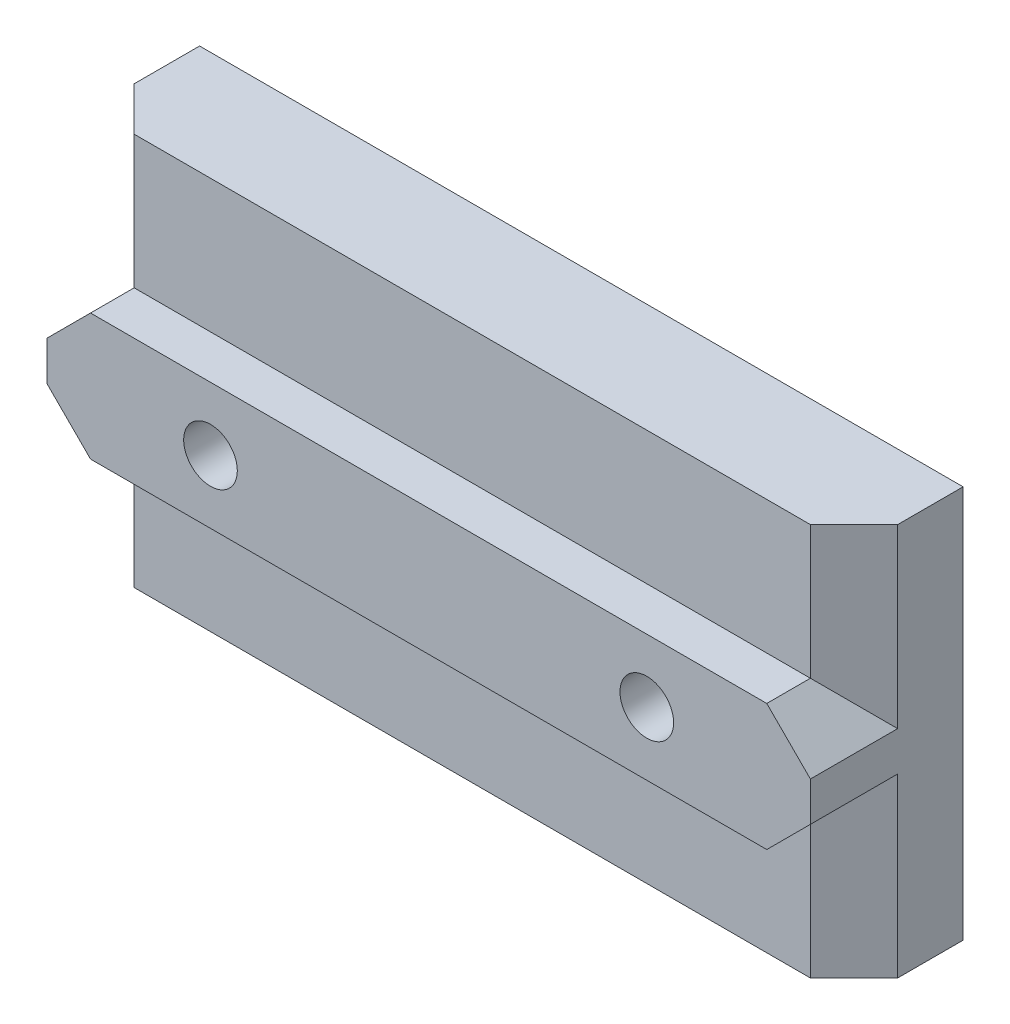
ISO-10303-21;
HEADER;
FILE_DESCRIPTION(('STEP AP214'),'2;1');
FILE_NAME('part.step','',(''),(''),'','','');
FILE_SCHEMA(('AUTOMOTIVE_DESIGN { 1 0 10303 214 1 1 1 1 }'));
ENDSEC;
DATA;
#1=APPLICATION_CONTEXT('core data for automotive mechanical design processes');
#2=APPLICATION_PROTOCOL_DEFINITION('international standard','automotive_design',2000,#1);
#3=PRODUCT_CONTEXT('',#1,'mechanical');
#4=PRODUCT('Part','Part','',(#3));
#5=PRODUCT_RELATED_PRODUCT_CATEGORY('part','',(#4));
#6=PRODUCT_DEFINITION_FORMATION('','',#4);
#7=PRODUCT_DEFINITION_CONTEXT('part definition',#1,'design');
#8=PRODUCT_DEFINITION('design','',#6,#7);
#9=PRODUCT_DEFINITION_SHAPE('','',#8);
#10=(LENGTH_UNIT() NAMED_UNIT(*) SI_UNIT(.MILLI.,.METRE.));
#11=(NAMED_UNIT(*) PLANE_ANGLE_UNIT() SI_UNIT($,.RADIAN.));
#12=(NAMED_UNIT(*) SI_UNIT($,.STERADIAN.) SOLID_ANGLE_UNIT());
#13=UNCERTAINTY_MEASURE_WITH_UNIT(LENGTH_MEASURE(1.E-05),#10,'distance_accuracy_value','');
#14=(GEOMETRIC_REPRESENTATION_CONTEXT(3) GLOBAL_UNCERTAINTY_ASSIGNED_CONTEXT((#13)) GLOBAL_UNIT_ASSIGNED_CONTEXT((#10,
#11,#12)) REPRESENTATION_CONTEXT('',''));
#15=CARTESIAN_POINT('',(0.,0.,0.));
#16=DIRECTION('',(0.,0.,1.));
#17=DIRECTION('',(1.,0.,0.));
#18=AXIS2_PLACEMENT_3D('',#15,#16,#17);
#19=CARTESIAN_POINT('',(-17.5,9.,0.));
#20=DIRECTION('',(-1.,0.,0.));
#21=DIRECTION('',(0.,0.,1.));
#22=AXIS2_PLACEMENT_3D('',#19,#20,#21);
#23=PLANE('',#22);
#24=DIRECTION('',(0.,0.,1.));
#25=VECTOR('',#24,1.);
#26=CARTESIAN_POINT('',(-17.5,-0.899999999999991,8.));
#27=LINE('',#26,#25);
#28=CARTESIAN_POINT('',(-17.5,-0.899999999999991,2.99999999999999));
#29=VERTEX_POINT('',#28);
#30=CARTESIAN_POINT('',(-17.5,-0.899999999999992,7.));
#31=VERTEX_POINT('',#30);
#32=EDGE_CURVE('E243',#29,#31,#27,.T.);
#33=ORIENTED_EDGE('',*,*,#32,.T.);
#34=DIRECTION('',(0.,1.,0.));
#35=VECTOR('',#34,1.);
#36=CARTESIAN_POINT('',(-17.5,-7.1,7.));
#37=LINE('',#36,#35);
#38=CARTESIAN_POINT('',(-17.5,0.899999999999988,7.));
#39=VERTEX_POINT('',#38);
#40=EDGE_CURVE('E152',#31,#39,#37,.T.);
#41=ORIENTED_EDGE('',*,*,#40,.T.);
#42=DIRECTION('',(0.,0.,-1.));
#43=VECTOR('',#42,1.);
#44=CARTESIAN_POINT('',(-17.5,0.899999999999991,5.));
#45=LINE('',#44,#43);
#46=CARTESIAN_POINT('',(-17.5,0.899999999999991,2.99999999999999));
#47=VERTEX_POINT('',#46);
#48=EDGE_CURVE('E150',#39,#47,#45,.T.);
#49=ORIENTED_EDGE('',*,*,#48,.T.);
#50=DIRECTION('',(0.,1.,0.));
#51=VECTOR('',#50,1.);
#52=CARTESIAN_POINT('',(-17.5,9.,2.99999999999999));
#53=LINE('',#52,#51);
#54=CARTESIAN_POINT('',(-17.5,9.,2.99999999999999));
#55=VERTEX_POINT('',#54);
#56=EDGE_CURVE('E241',#47,#55,#53,.T.);
#57=ORIENTED_EDGE('',*,*,#56,.T.);
#58=DIRECTION('',(0.,0.,1.));
#59=VECTOR('',#58,1.);
#60=CARTESIAN_POINT('',(-17.5,9.,0.));
#61=LINE('',#60,#59);
#62=CARTESIAN_POINT('',(-17.5,9.,0.));
#63=VERTEX_POINT('',#62);
#64=EDGE_CURVE('E213',#63,#55,#61,.T.);
#65=ORIENTED_EDGE('',*,*,#64,.F.);
#66=DIRECTION('',(0.,-1.,0.));
#67=VECTOR('',#66,1.);
#68=CARTESIAN_POINT('',(-17.5,9.,0.));
#69=LINE('',#68,#67);
#70=CARTESIAN_POINT('',(-17.5,-9.,0.));
#71=VERTEX_POINT('',#70);
#72=EDGE_CURVE('E205',#63,#71,#69,.T.);
#73=ORIENTED_EDGE('',*,*,#72,.T.);
#74=DIRECTION('',(0.,0.,1.));
#75=VECTOR('',#74,1.);
#76=CARTESIAN_POINT('',(-17.5,-9.,0.));
#77=LINE('',#76,#75);
#78=CARTESIAN_POINT('',(-17.5,-9.,2.99999999999999));
#79=VERTEX_POINT('',#78);
#80=EDGE_CURVE('E209',#71,#79,#77,.T.);
#81=ORIENTED_EDGE('',*,*,#80,.T.);
#82=DIRECTION('',(0.,1.,0.));
#83=VECTOR('',#82,1.);
#84=CARTESIAN_POINT('',(-17.5,-2.9,2.99999999999999));
#85=LINE('',#84,#83);
#86=EDGE_CURVE('E246',#79,#29,#85,.T.);
#87=ORIENTED_EDGE('',*,*,#86,.T.);
#88=EDGE_LOOP('',(#33,#41,#49,#57,#65,#73,#81,#87));
#89=FACE_BOUND('',#88,.T.);
#90=ADVANCED_FACE('F34',(#89),#23,.T.);
#91=CARTESIAN_POINT('',(17.5,-9.,0.));
#92=DIRECTION('',(1.,0.,0.));
#93=DIRECTION('',(0.,0.,-1.));
#94=AXIS2_PLACEMENT_3D('',#91,#92,#93);
#95=PLANE('',#94);
#96=DIRECTION('',(0.,0.,1.));
#97=VECTOR('',#96,1.);
#98=CARTESIAN_POINT('',(17.5,0.900000000000001,8.));
#99=LINE('',#98,#97);
#100=CARTESIAN_POINT('',(17.5,0.900000000000001,3.));
#101=VERTEX_POINT('',#100);
#102=CARTESIAN_POINT('',(17.5,0.900000000000001,7.));
#103=VERTEX_POINT('',#102);
#104=EDGE_CURVE('E253',#101,#103,#99,.T.);
#105=ORIENTED_EDGE('',*,*,#104,.T.);
#106=DIRECTION('',(0.,1.,0.));
#107=VECTOR('',#106,1.);
#108=CARTESIAN_POINT('',(17.5,-7.1,7.));
#109=LINE('',#108,#107);
#110=CARTESIAN_POINT('',(17.5,-0.900000000000001,7.));
#111=VERTEX_POINT('',#110);
#112=EDGE_CURVE('E49',#111,#103,#109,.T.);
#113=ORIENTED_EDGE('',*,*,#112,.F.);
#114=DIRECTION('',(0.,0.,-1.));
#115=VECTOR('',#114,1.);
#116=CARTESIAN_POINT('',(17.5,-0.900000000000001,5.));
#117=LINE('',#116,#115);
#118=CARTESIAN_POINT('',(17.5,-0.900000000000001,3.));
#119=VERTEX_POINT('',#118);
#120=EDGE_CURVE('E261',#111,#119,#117,.T.);
#121=ORIENTED_EDGE('',*,*,#120,.T.);
#122=DIRECTION('',(0.,-1.,0.));
#123=VECTOR('',#122,1.);
#124=CARTESIAN_POINT('',(17.5,-9.,3.));
#125=LINE('',#124,#123);
#126=CARTESIAN_POINT('',(17.5,-9.,3.));
#127=VERTEX_POINT('',#126);
#128=EDGE_CURVE('E259',#119,#127,#125,.T.);
#129=ORIENTED_EDGE('',*,*,#128,.T.);
#130=DIRECTION('',(0.,0.,1.));
#131=VECTOR('',#130,1.);
#132=CARTESIAN_POINT('',(17.5,-9.,0.));
#133=LINE('',#132,#131);
#134=CARTESIAN_POINT('',(17.5,-9.,0.));
#135=VERTEX_POINT('',#134);
#136=EDGE_CURVE('E208',#135,#127,#133,.T.);
#137=ORIENTED_EDGE('',*,*,#136,.F.);
#138=DIRECTION('',(0.,1.,0.));
#139=VECTOR('',#138,1.);
#140=CARTESIAN_POINT('',(17.5,-9.,0.));
#141=LINE('',#140,#139);
#142=CARTESIAN_POINT('',(17.5,9.,0.));
#143=VERTEX_POINT('',#142);
#144=EDGE_CURVE('E199',#135,#143,#141,.T.);
#145=ORIENTED_EDGE('',*,*,#144,.T.);
#146=DIRECTION('',(0.,0.,1.));
#147=VECTOR('',#146,1.);
#148=CARTESIAN_POINT('',(17.5,9.,0.));
#149=LINE('',#148,#147);
#150=CARTESIAN_POINT('',(17.5,9.,3.));
#151=VERTEX_POINT('',#150);
#152=EDGE_CURVE('E215',#143,#151,#149,.T.);
#153=ORIENTED_EDGE('',*,*,#152,.T.);
#154=DIRECTION('',(0.,-1.,0.));
#155=VECTOR('',#154,1.);
#156=CARTESIAN_POINT('',(17.5,2.9,3.));
#157=LINE('',#156,#155);
#158=EDGE_CURVE('E256',#151,#101,#157,.T.);
#159=ORIENTED_EDGE('',*,*,#158,.T.);
#160=EDGE_LOOP('',(#105,#113,#121,#129,#137,#145,#153,#159));
#161=FACE_BOUND('',#160,.T.);
#162=ADVANCED_FACE('F272',(#161),#95,.T.);
#163=CARTESIAN_POINT('',(17.5,2.9,5.));
#164=DIRECTION('',(0.,-1.,0.));
#165=DIRECTION('',(0.,0.,-1.));
#166=AXIS2_PLACEMENT_3D('',#163,#164,#165);
#167=PLANE('',#166);
#168=DIRECTION('',(1.,0.,0.));
#169=VECTOR('',#168,1.);
#170=CARTESIAN_POINT('',(-17.5,2.9,7.));
#171=LINE('',#170,#169);
#172=CARTESIAN_POINT('',(-15.5,2.9,7.));
#173=VERTEX_POINT('',#172);
#174=CARTESIAN_POINT('',(15.5,2.9,7.));
#175=VERTEX_POINT('',#174);
#176=EDGE_CURVE('E134',#173,#175,#171,.T.);
#177=ORIENTED_EDGE('',*,*,#176,.T.);
#178=DIRECTION('',(0.,0.,-1.));
#179=VECTOR('',#178,1.);
#180=CARTESIAN_POINT('',(15.5,2.9,5.));
#181=LINE('',#180,#179);
#182=CARTESIAN_POINT('',(15.5,2.9,5.));
#183=VERTEX_POINT('',#182);
#184=EDGE_CURVE('E158',#175,#183,#181,.T.);
#185=ORIENTED_EDGE('',*,*,#184,.T.);
#186=DIRECTION('',(-1.,0.,0.));
#187=VECTOR('',#186,1.);
#188=CARTESIAN_POINT('',(17.5,2.9,5.));
#189=LINE('',#188,#187);
#190=CARTESIAN_POINT('',(-15.5,2.9,5.));
#191=VERTEX_POINT('',#190);
#192=EDGE_CURVE('E157',#183,#191,#189,.T.);
#193=ORIENTED_EDGE('',*,*,#192,.T.);
#194=DIRECTION('',(0.,0.,1.));
#195=VECTOR('',#194,1.);
#196=CARTESIAN_POINT('',(-15.5,2.9,8.));
#197=LINE('',#196,#195);
#198=EDGE_CURVE('E42',#191,#173,#197,.T.);
#199=ORIENTED_EDGE('',*,*,#198,.T.);
#200=EDGE_LOOP('',(#177,#185,#193,#199));
#201=FACE_BOUND('',#200,.T.);
#202=ADVANCED_FACE('F155',(#201),#167,.F.);
#203=CARTESIAN_POINT('',(17.5,-2.9,8.));
#204=DIRECTION('',(0.,1.,0.));
#205=DIRECTION('',(0.,0.,1.));
#206=AXIS2_PLACEMENT_3D('',#203,#204,#205);
#207=PLANE('',#206);
#208=DIRECTION('',(1.,0.,0.));
#209=VECTOR('',#208,1.);
#210=CARTESIAN_POINT('',(17.5,-2.9,7.));
#211=LINE('',#210,#209);
#212=CARTESIAN_POINT('',(-15.5,-2.9,7.));
#213=VERTEX_POINT('',#212);
#214=CARTESIAN_POINT('',(15.5,-2.9,7.));
#215=VERTEX_POINT('',#214);
#216=EDGE_CURVE('E352',#213,#215,#211,.T.);
#217=ORIENTED_EDGE('',*,*,#216,.F.);
#218=DIRECTION('',(0.,0.,-1.));
#219=VECTOR('',#218,1.);
#220=CARTESIAN_POINT('',(-15.5,-2.9,5.));
#221=LINE('',#220,#219);
#222=CARTESIAN_POINT('',(-15.5,-2.9,5.));
#223=VERTEX_POINT('',#222);
#224=EDGE_CURVE('E251',#213,#223,#221,.T.);
#225=ORIENTED_EDGE('',*,*,#224,.T.);
#226=DIRECTION('',(-1.,0.,0.));
#227=VECTOR('',#226,1.);
#228=CARTESIAN_POINT('',(17.5,-2.9,5.));
#229=LINE('',#228,#227);
#230=CARTESIAN_POINT('',(15.5,-2.9,5.));
#231=VERTEX_POINT('',#230);
#232=EDGE_CURVE('E166',#231,#223,#229,.T.);
#233=ORIENTED_EDGE('',*,*,#232,.F.);
#234=DIRECTION('',(0.,0.,1.));
#235=VECTOR('',#234,1.);
#236=CARTESIAN_POINT('',(15.5,-2.9,8.));
#237=LINE('',#236,#235);
#238=EDGE_CURVE('E248',#231,#215,#237,.T.);
#239=ORIENTED_EDGE('',*,*,#238,.T.);
#240=EDGE_LOOP('',(#217,#225,#233,#239));
#241=FACE_BOUND('',#240,.T.);
#242=ADVANCED_FACE('F359',(#241),#207,.F.);
#243=CARTESIAN_POINT('',(10.,0.,8.));
#244=DIRECTION('',(0.,0.,1.));
#245=DIRECTION('',(1.,0.,0.));
#246=AXIS2_PLACEMENT_3D('',#243,#244,#245);
#247=CYLINDRICAL_SURFACE('',#246,1.22949999999999);
#248=CARTESIAN_POINT('',(10.,0.,0.270500000034322));
#249=DIRECTION('',(0.,0.,1.));
#250=DIRECTION('',(1.,0.,0.));
#251=AXIS2_PLACEMENT_3D('',#248,#249,#250);
#252=CIRCLE('',#251,1.22949999999999);
#253=CARTESIAN_POINT('',(11.2295,0.,0.270500000034322));
#254=VERTEX_POINT('',#253);
#255=EDGE_CURVE('E225',#254,#254,#252,.F.);
#256=ORIENTED_EDGE('',*,*,#255,.T.);
#257=EDGE_LOOP('',(#256));
#258=FACE_BOUND('',#257,.T.);
#259=CARTESIAN_POINT('',(10.,0.,7.));
#260=DIRECTION('',(0.,0.,1.));
#261=DIRECTION('',(1.,0.,0.));
#262=AXIS2_PLACEMENT_3D('',#259,#260,#261);
#263=CIRCLE('',#262,1.22949999999999);
#264=CARTESIAN_POINT('',(11.2295,0.,7.));
#265=VERTEX_POINT('',#264);
#266=EDGE_CURVE('E172',#265,#265,#263,.F.);
#267=ORIENTED_EDGE('',*,*,#266,.F.);
#268=EDGE_LOOP('',(#267));
#269=FACE_BOUND('',#268,.T.);
#270=ADVANCED_FACE('F372',(#258,#269),#247,.F.);
#271=CARTESIAN_POINT('',(-10.,0.,8.));
#272=DIRECTION('',(0.,0.,1.));
#273=DIRECTION('',(1.,0.,0.));
#274=AXIS2_PLACEMENT_3D('',#271,#272,#273);
#275=CYLINDRICAL_SURFACE('',#274,1.22949999999999);
#276=CARTESIAN_POINT('',(-10.,0.,0.270500000034322));
#277=DIRECTION('',(0.,0.,1.));
#278=DIRECTION('',(1.,0.,0.));
#279=AXIS2_PLACEMENT_3D('',#276,#277,#278);
#280=CIRCLE('',#279,1.22949999999999);
#281=CARTESIAN_POINT('',(-8.77050000000001,0.,0.270500000034322));
#282=VERTEX_POINT('',#281);
#283=EDGE_CURVE('E228',#282,#282,#280,.F.);
#284=ORIENTED_EDGE('',*,*,#283,.T.);
#285=EDGE_LOOP('',(#284));
#286=FACE_BOUND('',#285,.T.);
#287=CARTESIAN_POINT('',(-10.,0.,7.));
#288=DIRECTION('',(0.,0.,1.));
#289=DIRECTION('',(1.,0.,0.));
#290=AXIS2_PLACEMENT_3D('',#287,#288,#289);
#291=CIRCLE('',#290,1.22949999999999);
#292=CARTESIAN_POINT('',(-8.77050000000001,0.,7.));
#293=VERTEX_POINT('',#292);
#294=EDGE_CURVE('E179',#293,#293,#291,.F.);
#295=ORIENTED_EDGE('',*,*,#294,.F.);
#296=EDGE_LOOP('',(#295));
#297=FACE_BOUND('',#296,.T.);
#298=ADVANCED_FACE('F320',(#286,#297),#275,.F.);
#299=CARTESIAN_POINT('',(-15.5,-2.9,8.));
#300=DIRECTION('',(-0.707106781186549,-0.707106781186546,0.));
#301=DIRECTION('',(0.,0.,1.));
#302=AXIS2_PLACEMENT_3D('',#299,#300,#301);
#303=PLANE('',#302);
#304=ORIENTED_EDGE('',*,*,#224,.F.);
#305=DIRECTION('',(-0.707106781186546,0.707106781186549,0.));
#306=VECTOR('',#305,1.);
#307=CARTESIAN_POINT('',(-15.5,-2.9,7.));
#308=LINE('',#307,#306);
#309=EDGE_CURVE('E184',#213,#31,#308,.T.);
#310=ORIENTED_EDGE('',*,*,#309,.T.);
#311=ORIENTED_EDGE('',*,*,#32,.F.);
#312=DIRECTION('',(0.577350269189624,-0.577350269189626,0.577350269189626));
#313=VECTOR('',#312,1.);
#314=CARTESIAN_POINT('',(-15.5,-2.9,5.));
#315=LINE('',#314,#313);
#316=EDGE_CURVE('E163',#223,#29,#315,.F.);
#317=ORIENTED_EDGE('',*,*,#316,.F.);
#318=EDGE_LOOP('',(#304,#310,#311,#317));
#319=FACE_BOUND('',#318,.T.);
#320=ADVANCED_FACE('F316',(#319),#303,.T.);
#321=CARTESIAN_POINT('',(17.5,-0.900000000000001,0.));
#322=DIRECTION('',(0.707106781186546,-0.707106781186549,0.));
#323=DIRECTION('',(0.,0.,1.));
#324=AXIS2_PLACEMENT_3D('',#321,#322,#323);
#325=PLANE('',#324);
#326=ORIENTED_EDGE('',*,*,#120,.F.);
#327=DIRECTION('',(-0.707106781186549,-0.707106781186546,0.));
#328=VECTOR('',#327,1.);
#329=CARTESIAN_POINT('',(17.5,-0.900000000000001,7.));
#330=LINE('',#329,#328);
#331=EDGE_CURVE('E151',#111,#215,#330,.T.);
#332=ORIENTED_EDGE('',*,*,#331,.T.);
#333=ORIENTED_EDGE('',*,*,#238,.F.);
#334=DIRECTION('',(-0.577350269189628,-0.577350269189625,0.577350269189625));
#335=VECTOR('',#334,1.);
#336=CARTESIAN_POINT('',(18.5,0.0999999999999957,2.));
#337=LINE('',#336,#335);
#338=EDGE_CURVE('E167',#231,#119,#337,.F.);
#339=ORIENTED_EDGE('',*,*,#338,.T.);
#340=EDGE_LOOP('',(#326,#332,#333,#339));
#341=FACE_BOUND('',#340,.T.);
#342=ADVANCED_FACE('F319',(#341),#325,.T.);
#343=CARTESIAN_POINT('',(-15.5,2.9,5.));
#344=DIRECTION('',(-0.707106781186549,0.707106781186546,0.));
#345=DIRECTION('',(0.,0.,-1.));
#346=AXIS2_PLACEMENT_3D('',#343,#344,#345);
#347=PLANE('',#346);
#348=ORIENTED_EDGE('',*,*,#48,.F.);
#349=DIRECTION('',(0.707106781186546,0.707106781186549,0.));
#350=VECTOR('',#349,1.);
#351=CARTESIAN_POINT('',(-15.5,2.9,7.));
#352=LINE('',#351,#350);
#353=EDGE_CURVE('E138',#39,#173,#352,.T.);
#354=ORIENTED_EDGE('',*,*,#353,.T.);
#355=ORIENTED_EDGE('',*,*,#198,.F.);
#356=DIRECTION('',(-0.577350269189624,-0.577350269189626,-0.577350269189626));
#357=VECTOR('',#356,1.);
#358=CARTESIAN_POINT('',(-13.4666666666667,4.93333333333334,7.03333333333334));
#359=LINE('',#358,#357);
#360=EDGE_CURVE('E170',#47,#191,#359,.F.);
#361=ORIENTED_EDGE('',*,*,#360,.F.);
#362=EDGE_LOOP('',(#348,#354,#355,#361));
#363=FACE_BOUND('',#362,.T.);
#364=ADVANCED_FACE('F147',(#363),#347,.T.);
#365=CARTESIAN_POINT('',(17.5,0.900000000000001,0.));
#366=DIRECTION('',(0.707106781186546,0.707106781186549,0.));
#367=DIRECTION('',(0.,0.,-1.));
#368=AXIS2_PLACEMENT_3D('',#365,#366,#367);
#369=PLANE('',#368);
#370=ORIENTED_EDGE('',*,*,#184,.F.);
#371=DIRECTION('',(0.707106781186549,-0.707106781186546,0.));
#372=VECTOR('',#371,1.);
#373=CARTESIAN_POINT('',(17.5,0.900000000000001,7.));
#374=LINE('',#373,#372);
#375=EDGE_CURVE('E11',#175,#103,#374,.T.);
#376=ORIENTED_EDGE('',*,*,#375,.T.);
#377=ORIENTED_EDGE('',*,*,#104,.F.);
#378=DIRECTION('',(-0.577350269189628,0.577350269189625,0.577350269189625));
#379=VECTOR('',#378,1.);
#380=CARTESIAN_POINT('',(20.8,-2.39999999999999,-0.299999999999988));
#381=LINE('',#380,#379);
#382=EDGE_CURVE('E171',#183,#101,#381,.F.);
#383=ORIENTED_EDGE('',*,*,#382,.F.);
#384=EDGE_LOOP('',(#370,#376,#377,#383));
#385=FACE_BOUND('',#384,.T.);
#386=ADVANCED_FACE('F36',(#385),#369,.T.);
#387=CARTESIAN_POINT('',(-17.5,-9.,0.));
#388=DIRECTION('',(0.,-1.,0.));
#389=DIRECTION('',(0.,0.,-1.));
#390=AXIS2_PLACEMENT_3D('',#387,#388,#389);
#391=PLANE('',#390);
#392=DIRECTION('',(-1.,0.,0.));
#393=VECTOR('',#392,1.);
#394=CARTESIAN_POINT('',(17.5,-9.,5.));
#395=LINE('',#394,#393);
#396=CARTESIAN_POINT('',(15.5,-9.,5.));
#397=VERTEX_POINT('',#396);
#398=CARTESIAN_POINT('',(-15.5,-9.,5.));
#399=VERTEX_POINT('',#398);
#400=EDGE_CURVE('E188',#397,#399,#395,.T.);
#401=ORIENTED_EDGE('',*,*,#400,.T.);
#402=DIRECTION('',(-0.707106781186546,0.,-0.707106781186549));
#403=VECTOR('',#402,1.);
#404=CARTESIAN_POINT('',(-19.,-9.,1.49999999999999));
#405=LINE('',#404,#403);
#406=EDGE_CURVE('E238',#399,#79,#405,.T.);
#407=ORIENTED_EDGE('',*,*,#406,.T.);
#408=ORIENTED_EDGE('',*,*,#80,.F.);
#409=DIRECTION('',(1.,0.,0.));
#410=VECTOR('',#409,1.);
#411=CARTESIAN_POINT('',(-17.5,-9.,0.));
#412=LINE('',#411,#410);
#413=EDGE_CURVE('E195',#71,#135,#412,.T.);
#414=ORIENTED_EDGE('',*,*,#413,.T.);
#415=ORIENTED_EDGE('',*,*,#136,.T.);
#416=DIRECTION('',(-0.707106781186549,0.,0.707106781186546));
#417=VECTOR('',#416,1.);
#418=CARTESIAN_POINT('',(1.49999999999991,-9.,19.));
#419=LINE('',#418,#417);
#420=EDGE_CURVE('E236',#127,#397,#419,.T.);
#421=ORIENTED_EDGE('',*,*,#420,.T.);
#422=EDGE_LOOP('',(#401,#407,#408,#414,#415,#421));
#423=FACE_BOUND('',#422,.T.);
#424=ADVANCED_FACE('F298',(#423),#391,.T.);
#425=CARTESIAN_POINT('',(17.5,9.,0.));
#426=DIRECTION('',(0.,1.,0.));
#427=DIRECTION('',(0.,0.,1.));
#428=AXIS2_PLACEMENT_3D('',#425,#426,#427);
#429=PLANE('',#428);
#430=ORIENTED_EDGE('',*,*,#64,.T.);
#431=DIRECTION('',(0.707106781186546,0.,0.707106781186549));
#432=VECTOR('',#431,1.);
#433=CARTESIAN_POINT('',(-1.50000000000006,9.,19.));
#434=LINE('',#433,#432);
#435=CARTESIAN_POINT('',(-15.5,9.,5.));
#436=VERTEX_POINT('',#435);
#437=EDGE_CURVE('E56',#55,#436,#434,.T.);
#438=ORIENTED_EDGE('',*,*,#437,.T.);
#439=DIRECTION('',(-1.,0.,0.));
#440=VECTOR('',#439,1.);
#441=CARTESIAN_POINT('',(17.5,9.,5.));
#442=LINE('',#441,#440);
#443=CARTESIAN_POINT('',(15.5,9.,5.));
#444=VERTEX_POINT('',#443);
#445=EDGE_CURVE('E193',#444,#436,#442,.T.);
#446=ORIENTED_EDGE('',*,*,#445,.F.);
#447=DIRECTION('',(0.707106781186549,0.,-0.707106781186546));
#448=VECTOR('',#447,1.);
#449=CARTESIAN_POINT('',(19.,9.,1.50000000000001));
#450=LINE('',#449,#448);
#451=EDGE_CURVE('E267',#444,#151,#450,.T.);
#452=ORIENTED_EDGE('',*,*,#451,.T.);
#453=ORIENTED_EDGE('',*,*,#152,.F.);
#454=DIRECTION('',(-1.,0.,0.));
#455=VECTOR('',#454,1.);
#456=CARTESIAN_POINT('',(17.5,9.,0.));
#457=LINE('',#456,#455);
#458=EDGE_CURVE('E202',#143,#63,#457,.T.);
#459=ORIENTED_EDGE('',*,*,#458,.T.);
#460=EDGE_LOOP('',(#430,#438,#446,#452,#453,#459));
#461=FACE_BOUND('',#460,.T.);
#462=ADVANCED_FACE('F269',(#461),#429,.T.);
#463=CARTESIAN_POINT('',(0.,0.,0.));
#464=DIRECTION('',(0.,0.,1.));
#465=DIRECTION('',(1.,0.,0.));
#466=AXIS2_PLACEMENT_3D('',#463,#464,#465);
#467=PLANE('',#466);
#468=CARTESIAN_POINT('',(10.,0.,0.));
#469=DIRECTION('',(0.,0.,1.));
#470=DIRECTION('',(1.,0.,0.));
#471=AXIS2_PLACEMENT_3D('',#468,#469,#470);
#472=CIRCLE('',#471,1.50000000003431);
#473=CARTESIAN_POINT('',(11.5000000000343,0.,0.));
#474=VERTEX_POINT('',#473);
#475=EDGE_CURVE('E222',#474,#474,#472,.T.);
#476=ORIENTED_EDGE('',*,*,#475,.T.);
#477=EDGE_LOOP('',(#476));
#478=FACE_BOUND('',#477,.T.);
#479=CARTESIAN_POINT('',(-10.,0.,0.));
#480=DIRECTION('',(0.,0.,1.));
#481=DIRECTION('',(1.,0.,0.));
#482=AXIS2_PLACEMENT_3D('',#479,#480,#481);
#483=CIRCLE('',#482,1.50000000003431);
#484=CARTESIAN_POINT('',(-8.49999999996569,0.,0.));
#485=VERTEX_POINT('',#484);
#486=EDGE_CURVE('E212',#485,#485,#483,.T.);
#487=ORIENTED_EDGE('',*,*,#486,.T.);
#488=EDGE_LOOP('',(#487));
#489=FACE_BOUND('',#488,.T.);
#490=ORIENTED_EDGE('',*,*,#413,.F.);
#491=ORIENTED_EDGE('',*,*,#72,.F.);
#492=ORIENTED_EDGE('',*,*,#458,.F.);
#493=ORIENTED_EDGE('',*,*,#144,.F.);
#494=EDGE_LOOP('',(#490,#491,#492,#493));
#495=FACE_BOUND('',#494,.T.);
#496=ADVANCED_FACE('F295',(#478,#489,#495),#467,.F.);
#497=CARTESIAN_POINT('',(17.5,9.,5.));
#498=DIRECTION('',(0.,0.,-1.));
#499=DIRECTION('',(-1.,0.,0.));
#500=AXIS2_PLACEMENT_3D('',#497,#498,#499);
#501=PLANE('',#500);
#502=ORIENTED_EDGE('',*,*,#445,.T.);
#503=DIRECTION('',(0.,-1.,0.));
#504=VECTOR('',#503,1.);
#505=CARTESIAN_POINT('',(-15.5,2.9,5.));
#506=LINE('',#505,#504);
#507=EDGE_CURVE('E265',#436,#191,#506,.T.);
#508=ORIENTED_EDGE('',*,*,#507,.T.);
#509=ORIENTED_EDGE('',*,*,#192,.F.);
#510=DIRECTION('',(0.,1.,0.));
#511=VECTOR('',#510,1.);
#512=CARTESIAN_POINT('',(15.5,9.,5.));
#513=LINE('',#512,#511);
#514=EDGE_CURVE('E263',#183,#444,#513,.T.);
#515=ORIENTED_EDGE('',*,*,#514,.T.);
#516=EDGE_LOOP('',(#502,#508,#509,#515));
#517=FACE_BOUND('',#516,.T.);
#518=ADVANCED_FACE('F335',(#517),#501,.F.);
#519=CARTESIAN_POINT('',(17.5,-2.9,5.));
#520=DIRECTION('',(0.,0.,-1.));
#521=DIRECTION('',(-1.,0.,0.));
#522=AXIS2_PLACEMENT_3D('',#519,#520,#521);
#523=PLANE('',#522);
#524=ORIENTED_EDGE('',*,*,#232,.T.);
#525=DIRECTION('',(0.,-1.,0.));
#526=VECTOR('',#525,1.);
#527=CARTESIAN_POINT('',(-15.5,-9.,5.));
#528=LINE('',#527,#526);
#529=EDGE_CURVE('E233',#223,#399,#528,.T.);
#530=ORIENTED_EDGE('',*,*,#529,.T.);
#531=ORIENTED_EDGE('',*,*,#400,.F.);
#532=DIRECTION('',(0.,1.,0.));
#533=VECTOR('',#532,1.);
#534=CARTESIAN_POINT('',(15.5,-2.9,5.));
#535=LINE('',#534,#533);
#536=EDGE_CURVE('E231',#397,#231,#535,.T.);
#537=ORIENTED_EDGE('',*,*,#536,.T.);
#538=EDGE_LOOP('',(#524,#530,#531,#537));
#539=FACE_BOUND('',#538,.T.);
#540=ADVANCED_FACE('F307',(#539),#523,.F.);
#541=CARTESIAN_POINT('',(10.,0.,0.));
#542=DIRECTION('',(0.,0.,-1.));
#543=DIRECTION('',(-1.,0.,0.));
#544=AXIS2_PLACEMENT_3D('',#541,#542,#543);
#545=CONICAL_SURFACE('',#544,1.50000000003431,0.785398163397442);
#546=ORIENTED_EDGE('',*,*,#255,.F.);
#547=EDGE_LOOP('',(#546));
#548=FACE_BOUND('',#547,.T.);
#549=ORIENTED_EDGE('',*,*,#475,.F.);
#550=EDGE_LOOP('',(#549));
#551=FACE_BOUND('',#550,.T.);
#552=ADVANCED_FACE('F303',(#548,#551),#545,.F.);
#553=CARTESIAN_POINT('',(-10.,0.,0.));
#554=DIRECTION('',(0.,0.,-1.));
#555=DIRECTION('',(-1.,0.,0.));
#556=AXIS2_PLACEMENT_3D('',#553,#554,#555);
#557=CONICAL_SURFACE('',#556,1.50000000003431,0.785398163397442);
#558=ORIENTED_EDGE('',*,*,#283,.F.);
#559=EDGE_LOOP('',(#558));
#560=FACE_BOUND('',#559,.T.);
#561=ORIENTED_EDGE('',*,*,#486,.F.);
#562=EDGE_LOOP('',(#561));
#563=FACE_BOUND('',#562,.T.);
#564=ADVANCED_FACE('F306',(#560,#563),#557,.F.);
#565=CARTESIAN_POINT('',(-15.5,-2.9,5.));
#566=DIRECTION('',(-0.707106781186549,0.,0.707106781186546));
#567=DIRECTION('',(0.,1.,0.));
#568=AXIS2_PLACEMENT_3D('',#565,#566,#567);
#569=PLANE('',#568);
#570=ORIENTED_EDGE('',*,*,#316,.T.);
#571=ORIENTED_EDGE('',*,*,#86,.F.);
#572=ORIENTED_EDGE('',*,*,#406,.F.);
#573=ORIENTED_EDGE('',*,*,#529,.F.);
#574=EDGE_LOOP('',(#570,#571,#572,#573));
#575=FACE_BOUND('',#574,.T.);
#576=ADVANCED_FACE('F311',(#575),#569,.T.);
#577=CARTESIAN_POINT('',(17.5,-9.,3.));
#578=DIRECTION('',(0.707106781186546,0.,0.707106781186549));
#579=DIRECTION('',(0.,1.,0.));
#580=AXIS2_PLACEMENT_3D('',#577,#578,#579);
#581=PLANE('',#580);
#582=ORIENTED_EDGE('',*,*,#420,.F.);
#583=ORIENTED_EDGE('',*,*,#128,.F.);
#584=ORIENTED_EDGE('',*,*,#338,.F.);
#585=ORIENTED_EDGE('',*,*,#536,.F.);
#586=EDGE_LOOP('',(#582,#583,#584,#585));
#587=FACE_BOUND('',#586,.T.);
#588=ADVANCED_FACE('F282',(#587),#581,.T.);
#589=CARTESIAN_POINT('',(-15.5,9.,5.));
#590=DIRECTION('',(-0.707106781186549,0.,0.707106781186546));
#591=DIRECTION('',(0.,1.,0.));
#592=AXIS2_PLACEMENT_3D('',#589,#590,#591);
#593=PLANE('',#592);
#594=ORIENTED_EDGE('',*,*,#437,.F.);
#595=ORIENTED_EDGE('',*,*,#56,.F.);
#596=ORIENTED_EDGE('',*,*,#360,.T.);
#597=ORIENTED_EDGE('',*,*,#507,.F.);
#598=EDGE_LOOP('',(#594,#595,#596,#597));
#599=FACE_BOUND('',#598,.T.);
#600=ADVANCED_FACE('F276',(#599),#593,.T.);
#601=CARTESIAN_POINT('',(17.5,-9.,3.));
#602=DIRECTION('',(0.707106781186546,0.,0.707106781186549));
#603=DIRECTION('',(0.,1.,0.));
#604=AXIS2_PLACEMENT_3D('',#601,#602,#603);
#605=PLANE('',#604);
#606=ORIENTED_EDGE('',*,*,#451,.F.);
#607=ORIENTED_EDGE('',*,*,#514,.F.);
#608=ORIENTED_EDGE('',*,*,#382,.T.);
#609=ORIENTED_EDGE('',*,*,#158,.F.);
#610=EDGE_LOOP('',(#606,#607,#608,#609));
#611=FACE_BOUND('',#610,.T.);
#612=ADVANCED_FACE('F274',(#611),#605,.T.);
#613=CARTESIAN_POINT('',(-17.5,-7.1,7.));
#614=DIRECTION('',(0.,0.,1.));
#615=DIRECTION('',(1.,0.,0.));
#616=AXIS2_PLACEMENT_3D('',#613,#614,#615);
#617=PLANE('',#616);
#618=ORIENTED_EDGE('',*,*,#216,.T.);
#619=ORIENTED_EDGE('',*,*,#331,.F.);
#620=ORIENTED_EDGE('',*,*,#112,.T.);
#621=ORIENTED_EDGE('',*,*,#375,.F.);
#622=ORIENTED_EDGE('',*,*,#176,.F.);
#623=ORIENTED_EDGE('',*,*,#353,.F.);
#624=ORIENTED_EDGE('',*,*,#40,.F.);
#625=ORIENTED_EDGE('',*,*,#309,.F.);
#626=EDGE_LOOP('',(#618,#619,#620,#621,#622,#623,#624,#625));
#627=FACE_BOUND('',#626,.T.);
#628=ORIENTED_EDGE('',*,*,#294,.T.);
#629=EDGE_LOOP('',(#628));
#630=FACE_BOUND('',#629,.T.);
#631=ORIENTED_EDGE('',*,*,#266,.T.);
#632=EDGE_LOOP('',(#631));
#633=FACE_BOUND('',#632,.T.);
#634=ADVANCED_FACE('F136',(#627,#630,#633),#617,.T.);
#635=CLOSED_SHELL('',(#90,#162,#202,#242,#270,#298,#320,#342,#364,#386,#424,#462,#496,#518,#540,
#552,#564,#576,#588,#600,#612,#634));
#636=MANIFOLD_SOLID_BREP('B2',#635);
#637=ADVANCED_BREP_SHAPE_REPRESENTATION('',(#18,#636),#14);
#638=SHAPE_DEFINITION_REPRESENTATION(#9,#637);
ENDSEC;
END-ISO-10303-21;
